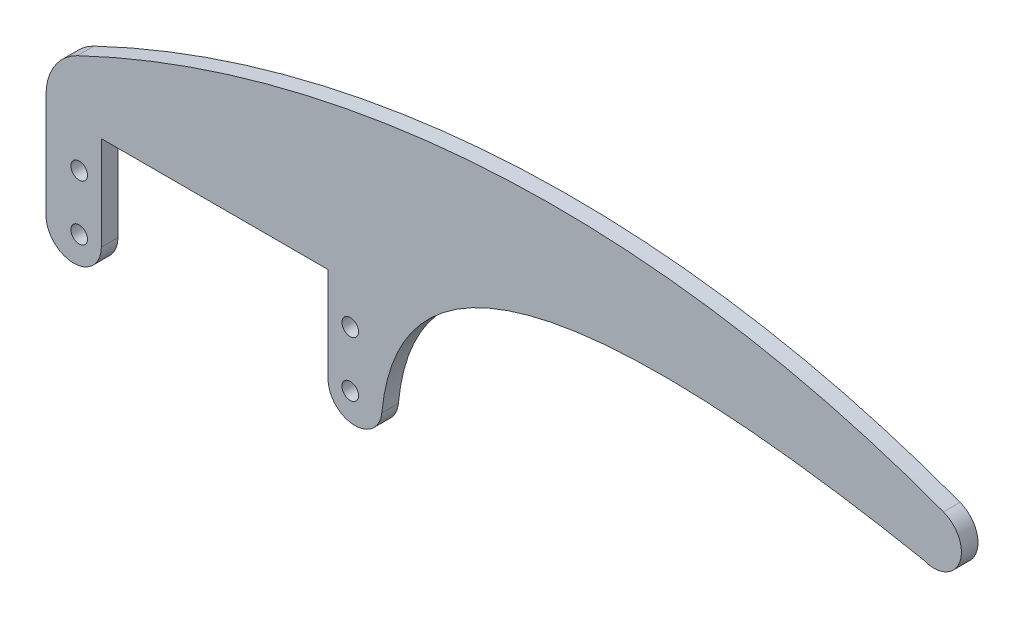
ISO-10303-21;
HEADER;
FILE_DESCRIPTION(('STEP AP214'),'2;1');
FILE_NAME('part.step','',(''),(''),'','','');
FILE_SCHEMA(('AUTOMOTIVE_DESIGN { 1 0 10303 214 1 1 1 1 }'));
ENDSEC;
DATA;
#1=APPLICATION_CONTEXT('core data for automotive mechanical design processes');
#2=APPLICATION_PROTOCOL_DEFINITION('international standard','automotive_design',2000,#1);
#3=PRODUCT_CONTEXT('',#1,'mechanical');
#4=PRODUCT('Part','Part','',(#3));
#5=PRODUCT_RELATED_PRODUCT_CATEGORY('part','',(#4));
#6=PRODUCT_DEFINITION_FORMATION('','',#4);
#7=PRODUCT_DEFINITION_CONTEXT('part definition',#1,'design');
#8=PRODUCT_DEFINITION('design','',#6,#7);
#9=PRODUCT_DEFINITION_SHAPE('','',#8);
#10=(LENGTH_UNIT() NAMED_UNIT(*) SI_UNIT(.MILLI.,.METRE.));
#11=(NAMED_UNIT(*) PLANE_ANGLE_UNIT() SI_UNIT($,.RADIAN.));
#12=(NAMED_UNIT(*) SI_UNIT($,.STERADIAN.) SOLID_ANGLE_UNIT());
#13=UNCERTAINTY_MEASURE_WITH_UNIT(LENGTH_MEASURE(1.E-05),#10,'distance_accuracy_value','');
#14=(GEOMETRIC_REPRESENTATION_CONTEXT(3) GLOBAL_UNCERTAINTY_ASSIGNED_CONTEXT((#13)) GLOBAL_UNIT_ASSIGNED_CONTEXT((#10,
#11,#12)) REPRESENTATION_CONTEXT('',''));
#15=CARTESIAN_POINT('',(0.,0.,0.));
#16=DIRECTION('',(0.,0.,1.));
#17=DIRECTION('',(1.,0.,0.));
#18=AXIS2_PLACEMENT_3D('',#15,#16,#17);
#19=CARTESIAN_POINT('',(-35.5,-5.,0.));
#20=DIRECTION('',(0.,0.,-1.));
#21=DIRECTION('',(-1.,0.,0.));
#22=AXIS2_PLACEMENT_3D('',#19,#20,#21);
#23=CYLINDRICAL_SURFACE('',#22,5.);
#24=DIRECTION('',(0.,0.,-1.));
#25=VECTOR('',#24,1.);
#26=CARTESIAN_POINT('',(-40.5,-5.,3.));
#27=LINE('',#26,#25);
#28=CARTESIAN_POINT('',(-40.5,-5.,0.));
#29=VERTEX_POINT('',#28);
#30=CARTESIAN_POINT('',(-40.5,-5.,3.));
#31=VERTEX_POINT('',#30);
#32=EDGE_CURVE('E230',#29,#31,#27,.F.);
#33=ORIENTED_EDGE('',*,*,#32,.F.);
#34=CARTESIAN_POINT('',(-35.5,-5.,0.));
#35=DIRECTION('',(0.,0.,1.));
#36=DIRECTION('',(1.,0.,0.));
#37=AXIS2_PLACEMENT_3D('',#34,#35,#36);
#38=CIRCLE('',#37,5.);
#39=CARTESIAN_POINT('',(-30.5,-5.,0.));
#40=VERTEX_POINT('',#39);
#41=EDGE_CURVE('E43',#40,#29,#38,.F.);
#42=ORIENTED_EDGE('',*,*,#41,.F.);
#43=DIRECTION('',(0.,0.,-1.));
#44=VECTOR('',#43,1.);
#45=CARTESIAN_POINT('',(-30.5,-5.,3.));
#46=LINE('',#45,#44);
#47=CARTESIAN_POINT('',(-30.5,-5.,3.));
#48=VERTEX_POINT('',#47);
#49=EDGE_CURVE('E238',#48,#40,#46,.T.);
#50=ORIENTED_EDGE('',*,*,#49,.F.);
#51=CARTESIAN_POINT('',(-35.5,-5.,3.));
#52=DIRECTION('',(0.,0.,1.));
#53=DIRECTION('',(1.,0.,0.));
#54=AXIS2_PLACEMENT_3D('',#51,#52,#53);
#55=CIRCLE('',#54,5.);
#56=EDGE_CURVE('E11',#31,#48,#55,.T.);
#57=ORIENTED_EDGE('',*,*,#56,.F.);
#58=EDGE_LOOP('',(#33,#42,#50,#57));
#59=FACE_BOUND('',#58,.T.);
#60=ADVANCED_FACE('F35',(#59),#23,.T.);
#61=CARTESIAN_POINT('',(20.2066380381264,-5.60614040867026,3.3));
#62=CARTESIAN_POINT('',(20.2066380381264,-5.60614040866997,3.19999999999997));
#63=CARTESIAN_POINT('',(20.2066380381264,-5.60614040867039,3.10000000000004));
#64=CARTESIAN_POINT('',(20.2066380381267,-5.60614040866727,1.99999999999965));
#65=CARTESIAN_POINT('',(20.2066380381264,-5.60614040867011,0.99999999999981));
#66=CARTESIAN_POINT('',(20.2066380381264,-5.60614040867011,-0.0999999999999801));
#67=CARTESIAN_POINT('',(20.2066380381264,-5.60614040867026,-0.200000000000015));
#68=CARTESIAN_POINT('',(20.2066380381264,-5.60614040867026,-0.300000000000001));
#69=CARTESIAN_POINT('',(19.3490863988907,-14.4240322566656,3.3));
#70=CARTESIAN_POINT('',(19.3490863988911,-14.4240322566661,3.19999999999996));
#71=CARTESIAN_POINT('',(19.3490863988905,-14.4240322566655,3.10000000000006));
#72=CARTESIAN_POINT('',(19.3490863988943,-14.4240322566702,1.99999999999944));
#73=CARTESIAN_POINT('',(19.3490863988909,-14.4240322566659,0.99999999999981));
#74=CARTESIAN_POINT('',(19.3490863988909,-14.4240322566659,-0.0999999999999803));
#75=CARTESIAN_POINT('',(19.3490863988907,-14.4240322566656,-0.200000000000014));
#76=CARTESIAN_POINT('',(19.3490863988907,-14.4240322566656,-0.300000000000001));
#77=CARTESIAN_POINT('',(10.4999999999999,-13.9947522060425,3.3));
#78=CARTESIAN_POINT('',(10.4999999999995,-13.994752206043,3.19999999999999));
#79=CARTESIAN_POINT('',(10.5,-13.9947522060422,3.10000000000001));
#80=CARTESIAN_POINT('',(10.4999999999962,-13.9947522060479,1.99999999999987));
#81=CARTESIAN_POINT('',(10.4999999999996,-13.9947522060427,0.999999999999809));
#82=CARTESIAN_POINT('',(10.4999999999996,-13.9947522060427,-0.099999999999981));
#83=CARTESIAN_POINT('',(10.4999999999999,-13.9947522060425,-0.200000000000012));
#84=CARTESIAN_POINT('',(10.4999999999999,-13.9947522060425,-0.3));
#85=CARTESIAN_POINT('',(10.5,-5.13525947468932,3.3));
#86=CARTESIAN_POINT('',(10.5,-5.13525947468911,3.20000000000001));
#87=CARTESIAN_POINT('',(10.5,-5.13525947468935,3.09999999999999));
#88=CARTESIAN_POINT('',(10.5,-5.13525947468696,2.00000000000009));
#89=CARTESIAN_POINT('',(10.5,-5.13525947468913,0.999999999999809));
#90=CARTESIAN_POINT('',(10.5,-5.13525947468913,-0.099999999999981));
#91=CARTESIAN_POINT('',(10.5,-5.13525947468932,-0.200000000000012));
#92=CARTESIAN_POINT('',(10.5,-5.13525947468932,-0.3));
#93=(BOUNDED_SURFACE() B_SPLINE_SURFACE(3,3,((#61,#62,#63,#64,#65,#66,#67,#68),(#69,#70,#71,#72,
#73,#74,#75,#76),(#77,#78,#79,#80,#81,#82,#83,#84),(#85,#86,#87,#88,#89,#90,#91,#92)),
.UNSPECIFIED.,.F.,.F.,.F.) B_SPLINE_SURFACE_WITH_KNOTS((4,4),(4,2,2,4),(0.,1.),(-0.1,0.,1.,1.1),
.UNSPECIFIED.) GEOMETRIC_REPRESENTATION_ITEM() RATIONAL_B_SPLINE_SURFACE(((1.,1.,1.,1.,1.,1.,1.,
1.),(0.365636164781296,0.365636164781296,0.365636164781282,0.365636164781282,0.365636164781282,
0.365636164781282,0.365636164781296,0.365636164781296),(0.365636164781296,0.365636164781296,
0.365636164781282,0.365636164781282,0.365636164781282,0.365636164781282,0.365636164781296,
0.365636164781296),(1.,1.,1.,1.,1.,1.,1.,1.))) REPRESENTATION_ITEM('') SURFACE());
#94=CARTESIAN_POINT('',(10.5,-5.13525947468932,3.3));
#95=CARTESIAN_POINT('',(10.5,-5.13525947468911,3.20000000000001));
#96=CARTESIAN_POINT('',(10.5,-5.13525947468935,3.09999999999999));
#97=CARTESIAN_POINT('',(10.5,-5.13525947468696,2.00000000000009));
#98=CARTESIAN_POINT('',(10.5,-5.13525947468913,0.999999999999809));
#99=CARTESIAN_POINT('',(10.5,-5.13525947468913,-0.099999999999981));
#100=CARTESIAN_POINT('',(10.5,-5.13525947468932,-0.200000000000012));
#101=CARTESIAN_POINT('',(10.5,-5.13525947468932,-0.3));
#102=(BOUNDED_CURVE() B_SPLINE_CURVE(3,(#94,#95,#96,#97,#98,#99,#100,#101),.UNSPECIFIED.,.F.,
.F.) B_SPLINE_CURVE_WITH_KNOTS((4,2,2,4),(-0.1,0.,1.,1.1),
.UNSPECIFIED.) CURVE() GEOMETRIC_REPRESENTATION_ITEM() RATIONAL_B_SPLINE_CURVE((1.,1.,1.,1.,1.,
1.,1.,1.)) REPRESENTATION_ITEM(''));
#103=CARTESIAN_POINT('',(10.5,-5.13525947468913,0.));
#104=VERTEX_POINT('',#103);
#105=CARTESIAN_POINT('',(10.5,-5.13525947468913,3.));
#106=VERTEX_POINT('',#105);
#107=EDGE_CURVE('E153',#104,#106,#102,.F.);
#108=CARTESIAN_POINT('',(10.5,-5.13525947468913,0.));
#109=CARTESIAN_POINT('',(10.4999999999996,-13.9947522060427,0.));
#110=CARTESIAN_POINT('',(19.3490863988909,-14.4240322566659,0.));
#111=CARTESIAN_POINT('',(20.2066380381264,-5.60614040867011,0.));
#112=(BOUNDED_CURVE() B_SPLINE_CURVE(3,(#108,#109,#110,#111),.UNSPECIFIED.,.F.,
.F.) B_SPLINE_CURVE_WITH_KNOTS((4,4),(0.,1.),
.UNSPECIFIED.) CURVE() GEOMETRIC_REPRESENTATION_ITEM() RATIONAL_B_SPLINE_CURVE((1.,
0.365636164781282,0.365636164781282,1.)) REPRESENTATION_ITEM(''));
#113=CARTESIAN_POINT('',(20.2066380381264,-5.60614040867011,0.));
#114=VERTEX_POINT('',#113);
#115=EDGE_CURVE('E284',#114,#104,#112,.F.);
#116=CARTESIAN_POINT('',(20.2066380381264,-5.60614040867011,3.00000000000062));
#117=DIRECTION('',(0.,0.,-1.));
#118=VECTOR('',#117,1.);
#119=LINE('',#116,#118);
#120=CARTESIAN_POINT('',(20.2066380381264,-5.60614040867011,3.));
#121=VERTEX_POINT('',#120);
#122=EDGE_CURVE('E282',#121,#114,#119,.T.);
#123=CARTESIAN_POINT('',(20.2066380381264,-5.60614040867011,3.));
#124=CARTESIAN_POINT('',(19.3490863988909,-14.4240322566659,3.));
#125=CARTESIAN_POINT('',(10.4999999999996,-13.9947522060427,3.));
#126=CARTESIAN_POINT('',(10.5,-5.13525947468913,3.));
#127=(BOUNDED_CURVE() B_SPLINE_CURVE(3,(#123,#124,#125,#126),.UNSPECIFIED.,.F.,
.F.) B_SPLINE_CURVE_WITH_KNOTS((4,4),(0.,1.),
.UNSPECIFIED.) CURVE() GEOMETRIC_REPRESENTATION_ITEM() RATIONAL_B_SPLINE_CURVE((1.,
0.365636164781282,0.365636164781282,1.)) REPRESENTATION_ITEM(''));
#128=EDGE_CURVE('E226',#106,#121,#127,.F.);
#129=ORIENTED_EDGE('',*,*,#107,.F.);
#130=ORIENTED_EDGE('',*,*,#115,.F.);
#131=ORIENTED_EDGE('',*,*,#122,.F.);
#132=ORIENTED_EDGE('',*,*,#128,.F.);
#133=EDGE_LOOP('',(#129,#130,#131,#132));
#134=FACE_BOUND('',#133,.T.);
#135=ADVANCED_FACE('F189',(#134),#93,.T.);
#136=CARTESIAN_POINT('',(-30.5,13.8109959771921,3.));
#137=DIRECTION('',(0.,0.,-1.));
#138=DIRECTION('',(-1.,0.,0.));
#139=AXIS2_PLACEMENT_3D('',#136,#137,#138);
#140=CYLINDRICAL_SURFACE('',#139,10.);
#141=DIRECTION('',(0.,0.,-1.));
#142=VECTOR('',#141,1.);
#143=CARTESIAN_POINT('',(-40.5,13.8109959771921,3.));
#144=LINE('',#143,#142);
#145=CARTESIAN_POINT('',(-40.5,13.8109959771917,3.));
#146=VERTEX_POINT('',#145);
#147=CARTESIAN_POINT('',(-40.5,13.8109959771917,0.));
#148=VERTEX_POINT('',#147);
#149=EDGE_CURVE('E125',#146,#148,#144,.T.);
#150=ORIENTED_EDGE('',*,*,#149,.F.);
#151=CARTESIAN_POINT('',(-30.5,13.8109959771921,3.));
#152=DIRECTION('',(0.,0.,1.));
#153=DIRECTION('',(1.,0.,0.));
#154=AXIS2_PLACEMENT_3D('',#151,#152,#153);
#155=CIRCLE('',#154,10.);
#156=CARTESIAN_POINT('',(-34.816449073427,22.831432075104,3.));
#157=VERTEX_POINT('',#156);
#158=EDGE_CURVE('E278',#157,#146,#155,.T.);
#159=ORIENTED_EDGE('',*,*,#158,.F.);
#160=DIRECTION('',(0.,0.,-1.));
#161=VECTOR('',#160,1.);
#162=CARTESIAN_POINT('',(-34.816449073427,22.831432075104,3.));
#163=LINE('',#162,#161);
#164=CARTESIAN_POINT('',(-34.816449073427,22.831432075104,0.));
#165=VERTEX_POINT('',#164);
#166=EDGE_CURVE('E275',#165,#157,#163,.F.);
#167=ORIENTED_EDGE('',*,*,#166,.F.);
#168=CARTESIAN_POINT('',(-30.5,13.8109959771921,0.));
#169=DIRECTION('',(0.,0.,1.));
#170=DIRECTION('',(1.,0.,0.));
#171=AXIS2_PLACEMENT_3D('',#168,#169,#170);
#172=CIRCLE('',#171,10.);
#173=EDGE_CURVE('E279',#148,#165,#172,.F.);
#174=ORIENTED_EDGE('',*,*,#173,.F.);
#175=EDGE_LOOP('',(#150,#159,#167,#174));
#176=FACE_BOUND('',#175,.T.);
#177=ADVANCED_FACE('F187',(#176),#140,.T.);
#178=CARTESIAN_POINT('',(51.5125323951132,-157.577289883133,3.));
#179=DIRECTION('',(0.,0.,1.));
#180=DIRECTION('',(1.,0.,0.));
#181=AXIS2_PLACEMENT_3D('',#178,#179,#180);
#182=PLANE('',#181);
#183=CARTESIAN_POINT('',(14.5,5.,3.));
#184=DIRECTION('',(0.,0.,1.));
#185=DIRECTION('',(1.,0.,0.));
#186=AXIS2_PLACEMENT_3D('',#183,#184,#185);
#187=CIRCLE('',#186,1.5);
#188=CARTESIAN_POINT('',(16.,5.,3.));
#189=VERTEX_POINT('',#188);
#190=EDGE_CURVE('E435',#189,#189,#187,.T.);
#191=ORIENTED_EDGE('',*,*,#190,.F.);
#192=EDGE_LOOP('',(#191));
#193=FACE_BOUND('',#192,.T.);
#194=CARTESIAN_POINT('',(-34.5,-5.,3.));
#195=DIRECTION('',(0.,0.,1.));
#196=DIRECTION('',(1.,0.,0.));
#197=AXIS2_PLACEMENT_3D('',#194,#195,#196);
#198=CIRCLE('',#197,1.5);
#199=CARTESIAN_POINT('',(-33.,-5.,3.));
#200=VERTEX_POINT('',#199);
#201=EDGE_CURVE('E252',#200,#200,#198,.T.);
#202=ORIENTED_EDGE('',*,*,#201,.F.);
#203=EDGE_LOOP('',(#202));
#204=FACE_BOUND('',#203,.T.);
#205=DIRECTION('',(0.,-1.,0.));
#206=VECTOR('',#205,1.);
#207=CARTESIAN_POINT('',(-40.5,20.,3.));
#208=LINE('',#207,#206);
#209=EDGE_CURVE('E116',#146,#31,#208,.T.);
#210=ORIENTED_EDGE('',*,*,#209,.T.);
#211=ORIENTED_EDGE('',*,*,#56,.T.);
#212=DIRECTION('',(0.,1.,0.));
#213=VECTOR('',#212,1.);
#214=CARTESIAN_POINT('',(-30.5,-10.,3.));
#215=LINE('',#214,#213);
#216=CARTESIAN_POINT('',(-30.5,12.,3.));
#217=VERTEX_POINT('',#216);
#218=EDGE_CURVE('E107',#48,#217,#215,.T.);
#219=ORIENTED_EDGE('',*,*,#218,.T.);
#220=DIRECTION('',(1.,0.,0.));
#221=VECTOR('',#220,1.);
#222=CARTESIAN_POINT('',(-30.5,12.,3.));
#223=LINE('',#222,#221);
#224=CARTESIAN_POINT('',(10.5,12.,3.));
#225=VERTEX_POINT('',#224);
#226=EDGE_CURVE('E113',#217,#225,#223,.T.);
#227=ORIENTED_EDGE('',*,*,#226,.T.);
#228=DIRECTION('',(0.,-1.,0.));
#229=VECTOR('',#228,1.);
#230=CARTESIAN_POINT('',(10.5,-10.,3.));
#231=LINE('',#230,#229);
#232=EDGE_CURVE('E131',#225,#106,#231,.T.);
#233=ORIENTED_EDGE('',*,*,#232,.T.);
#234=ORIENTED_EDGE('',*,*,#128,.T.);
#235=CARTESIAN_POINT('',(20.,-10.,3.));
#236=CARTESIAN_POINT('',(20.,39.4361634219413,3.));
#237=CARTESIAN_POINT('',(118.084820575141,20.3813326845727,3.));
#238=B_SPLINE_CURVE_WITH_KNOTS('',2,(#235,#236,#237),.UNSPECIFIED.,.F.,.F.,(3,3),(0.,1.),.UNSPECIFIED.);
#239=CARTESIAN_POINT('',(118.084820575141,20.3813326845727,3.));
#240=VERTEX_POINT('',#239);
#241=EDGE_CURVE('E133',#121,#240,#238,.T.);
#242=ORIENTED_EDGE('',*,*,#241,.T.);
#243=CARTESIAN_POINT('',(120.,25.,3.));
#244=DIRECTION('',(0.,0.,1.));
#245=DIRECTION('',(1.,0.,0.));
#246=AXIS2_PLACEMENT_3D('',#243,#244,#245);
#247=CIRCLE('',#246,5.00000000000004);
#248=CARTESIAN_POINT('',(121.756088912946,29.6814689713624,3.));
#249=VERTEX_POINT('',#248);
#250=EDGE_CURVE('E270',#240,#249,#247,.T.);
#251=ORIENTED_EDGE('',*,*,#250,.T.);
#252=CARTESIAN_POINT('',(51.5125323951132,-157.577289883133,3.));
#253=DIRECTION('',(0.,0.,1.));
#254=DIRECTION('',(1.,0.,0.));
#255=AXIS2_PLACEMENT_3D('',#252,#253,#254);
#256=CIRCLE('',#255,200.);
#257=EDGE_CURVE('E265',#249,#157,#256,.T.);
#258=ORIENTED_EDGE('',*,*,#257,.T.);
#259=ORIENTED_EDGE('',*,*,#158,.T.);
#260=EDGE_LOOP('',(#210,#211,#219,#227,#233,#234,#242,#251,#258,#259));
#261=FACE_BOUND('',#260,.T.);
#262=CARTESIAN_POINT('',(-34.5,5.,3.));
#263=DIRECTION('',(0.,0.,1.));
#264=DIRECTION('',(1.,0.,0.));
#265=AXIS2_PLACEMENT_3D('',#262,#263,#264);
#266=CIRCLE('',#265,1.5);
#267=CARTESIAN_POINT('',(-33.,5.,3.));
#268=VERTEX_POINT('',#267);
#269=EDGE_CURVE('E441',#268,#268,#266,.T.);
#270=ORIENTED_EDGE('',*,*,#269,.F.);
#271=EDGE_LOOP('',(#270));
#272=FACE_BOUND('',#271,.T.);
#273=CARTESIAN_POINT('',(14.5,-5.,3.));
#274=DIRECTION('',(0.,0.,1.));
#275=DIRECTION('',(1.,0.,0.));
#276=AXIS2_PLACEMENT_3D('',#273,#274,#275);
#277=CIRCLE('',#276,1.5);
#278=CARTESIAN_POINT('',(16.,-5.,3.));
#279=VERTEX_POINT('',#278);
#280=EDGE_CURVE('E426',#279,#279,#277,.T.);
#281=ORIENTED_EDGE('',*,*,#280,.F.);
#282=EDGE_LOOP('',(#281));
#283=FACE_BOUND('',#282,.T.);
#284=ADVANCED_FACE('F109',(#193,#204,#261,#272,#283),#182,.T.);
#285=CARTESIAN_POINT('',(51.5125323951132,-157.577289883133,0.));
#286=DIRECTION('',(0.,0.,1.));
#287=DIRECTION('',(1.,0.,0.));
#288=AXIS2_PLACEMENT_3D('',#285,#286,#287);
#289=PLANE('',#288);
#290=DIRECTION('',(0.,1.,0.));
#291=VECTOR('',#290,1.);
#292=CARTESIAN_POINT('',(-30.5,-10.,0.));
#293=LINE('',#292,#291);
#294=CARTESIAN_POINT('',(-30.5,12.,0.));
#295=VERTEX_POINT('',#294);
#296=EDGE_CURVE('E122',#40,#295,#293,.T.);
#297=ORIENTED_EDGE('',*,*,#296,.F.);
#298=ORIENTED_EDGE('',*,*,#41,.T.);
#299=DIRECTION('',(0.,-1.,0.));
#300=VECTOR('',#299,1.);
#301=CARTESIAN_POINT('',(-40.5,20.,0.));
#302=LINE('',#301,#300);
#303=EDGE_CURVE('E243',#148,#29,#302,.T.);
#304=ORIENTED_EDGE('',*,*,#303,.F.);
#305=ORIENTED_EDGE('',*,*,#173,.T.);
#306=CARTESIAN_POINT('',(51.5125323951132,-157.577289883133,0.));
#307=DIRECTION('',(0.,0.,1.));
#308=DIRECTION('',(1.,0.,0.));
#309=AXIS2_PLACEMENT_3D('',#306,#307,#308);
#310=CIRCLE('',#309,200.);
#311=CARTESIAN_POINT('',(121.756088912946,29.6814689713624,0.));
#312=VERTEX_POINT('',#311);
#313=EDGE_CURVE('E247',#312,#165,#310,.T.);
#314=ORIENTED_EDGE('',*,*,#313,.F.);
#315=CARTESIAN_POINT('',(120.,25.,0.));
#316=DIRECTION('',(0.,0.,1.));
#317=DIRECTION('',(1.,0.,0.));
#318=AXIS2_PLACEMENT_3D('',#315,#316,#317);
#319=CIRCLE('',#318,5.00000000000004);
#320=CARTESIAN_POINT('',(118.084820575141,20.3813326845727,0.));
#321=VERTEX_POINT('',#320);
#322=EDGE_CURVE('E260',#321,#312,#319,.T.);
#323=ORIENTED_EDGE('',*,*,#322,.F.);
#324=CARTESIAN_POINT('',(20.,-10.,0.));
#325=CARTESIAN_POINT('',(20.,39.4361634219413,0.));
#326=CARTESIAN_POINT('',(118.084820575141,20.3813326845727,0.));
#327=B_SPLINE_CURVE_WITH_KNOTS('',2,(#324,#325,#326),.UNSPECIFIED.,.F.,.F.,(3,3),(0.,1.),.UNSPECIFIED.);
#328=EDGE_CURVE('E158',#114,#321,#327,.T.);
#329=ORIENTED_EDGE('',*,*,#328,.F.);
#330=ORIENTED_EDGE('',*,*,#115,.T.);
#331=DIRECTION('',(0.,-1.,0.));
#332=VECTOR('',#331,1.);
#333=CARTESIAN_POINT('',(10.5,-10.,0.));
#334=LINE('',#333,#332);
#335=CARTESIAN_POINT('',(10.5,12.,0.));
#336=VERTEX_POINT('',#335);
#337=EDGE_CURVE('E145',#336,#104,#334,.T.);
#338=ORIENTED_EDGE('',*,*,#337,.F.);
#339=DIRECTION('',(1.,0.,0.));
#340=VECTOR('',#339,1.);
#341=CARTESIAN_POINT('',(-30.5,12.,0.));
#342=LINE('',#341,#340);
#343=EDGE_CURVE('E249',#295,#336,#342,.T.);
#344=ORIENTED_EDGE('',*,*,#343,.F.);
#345=EDGE_LOOP('',(#297,#298,#304,#305,#314,#323,#329,#330,#338,#344));
#346=FACE_BOUND('',#345,.T.);
#347=CARTESIAN_POINT('',(-34.5,-5.,0.));
#348=DIRECTION('',(0.,0.,1.));
#349=DIRECTION('',(1.,0.,0.));
#350=AXIS2_PLACEMENT_3D('',#347,#348,#349);
#351=CIRCLE('',#350,1.5);
#352=CARTESIAN_POINT('',(-33.,-5.,0.));
#353=VERTEX_POINT('',#352);
#354=EDGE_CURVE('E444',#353,#353,#351,.T.);
#355=ORIENTED_EDGE('',*,*,#354,.T.);
#356=EDGE_LOOP('',(#355));
#357=FACE_BOUND('',#356,.T.);
#358=CARTESIAN_POINT('',(-34.5,5.,0.));
#359=DIRECTION('',(0.,0.,1.));
#360=DIRECTION('',(1.,0.,0.));
#361=AXIS2_PLACEMENT_3D('',#358,#359,#360);
#362=CIRCLE('',#361,1.5);
#363=CARTESIAN_POINT('',(-33.,5.,0.));
#364=VERTEX_POINT('',#363);
#365=EDGE_CURVE('E438',#364,#364,#362,.T.);
#366=ORIENTED_EDGE('',*,*,#365,.T.);
#367=EDGE_LOOP('',(#366));
#368=FACE_BOUND('',#367,.T.);
#369=CARTESIAN_POINT('',(14.5,5.,0.));
#370=DIRECTION('',(0.,0.,1.));
#371=DIRECTION('',(1.,0.,0.));
#372=AXIS2_PLACEMENT_3D('',#369,#370,#371);
#373=CIRCLE('',#372,1.5);
#374=CARTESIAN_POINT('',(16.,5.,0.));
#375=VERTEX_POINT('',#374);
#376=EDGE_CURVE('E432',#375,#375,#373,.T.);
#377=ORIENTED_EDGE('',*,*,#376,.T.);
#378=EDGE_LOOP('',(#377));
#379=FACE_BOUND('',#378,.T.);
#380=CARTESIAN_POINT('',(14.5,-5.,0.));
#381=DIRECTION('',(0.,0.,1.));
#382=DIRECTION('',(1.,0.,0.));
#383=AXIS2_PLACEMENT_3D('',#380,#381,#382);
#384=CIRCLE('',#383,1.5);
#385=CARTESIAN_POINT('',(16.,-5.,0.));
#386=VERTEX_POINT('',#385);
#387=EDGE_CURVE('E429',#386,#386,#384,.T.);
#388=ORIENTED_EDGE('',*,*,#387,.T.);
#389=EDGE_LOOP('',(#388));
#390=FACE_BOUND('',#389,.T.);
#391=ADVANCED_FACE('F185',(#346,#357,#368,#379,#390),#289,.F.);
#392=CARTESIAN_POINT('',(51.5125323951132,-157.577289883133,3.));
#393=DIRECTION('',(0.,0.,-1.));
#394=DIRECTION('',(-1.,0.,0.));
#395=AXIS2_PLACEMENT_3D('',#392,#393,#394);
#396=CYLINDRICAL_SURFACE('',#395,200.);
#397=ORIENTED_EDGE('',*,*,#313,.T.);
#398=ORIENTED_EDGE('',*,*,#166,.T.);
#399=ORIENTED_EDGE('',*,*,#257,.F.);
#400=DIRECTION('',(0.,0.,-1.));
#401=VECTOR('',#400,1.);
#402=CARTESIAN_POINT('',(121.756088912946,29.6814689713624,3.));
#403=LINE('',#402,#401);
#404=EDGE_CURVE('E266',#249,#312,#403,.T.);
#405=ORIENTED_EDGE('',*,*,#404,.T.);
#406=EDGE_LOOP('',(#397,#398,#399,#405));
#407=FACE_BOUND('',#406,.T.);
#408=ADVANCED_FACE('F181',(#407),#396,.T.);
#409=CARTESIAN_POINT('',(-40.5,20.,3.));
#410=DIRECTION('',(1.,0.,0.));
#411=DIRECTION('',(0.,1.,0.));
#412=AXIS2_PLACEMENT_3D('',#409,#410,#411);
#413=PLANE('',#412);
#414=ORIENTED_EDGE('',*,*,#303,.T.);
#415=ORIENTED_EDGE('',*,*,#32,.T.);
#416=ORIENTED_EDGE('',*,*,#209,.F.);
#417=ORIENTED_EDGE('',*,*,#149,.T.);
#418=EDGE_LOOP('',(#414,#415,#416,#417));
#419=FACE_BOUND('',#418,.T.);
#420=ADVANCED_FACE('F178',(#419),#413,.F.);
#421=CARTESIAN_POINT('',(-30.5,-10.,3.));
#422=DIRECTION('',(-1.,0.,0.));
#423=DIRECTION('',(0.,0.,1.));
#424=AXIS2_PLACEMENT_3D('',#421,#422,#423);
#425=PLANE('',#424);
#426=ORIENTED_EDGE('',*,*,#218,.F.);
#427=ORIENTED_EDGE('',*,*,#49,.T.);
#428=ORIENTED_EDGE('',*,*,#296,.T.);
#429=DIRECTION('',(0.,0.,-1.));
#430=VECTOR('',#429,1.);
#431=CARTESIAN_POINT('',(-30.5,12.,3.));
#432=LINE('',#431,#430);
#433=EDGE_CURVE('E119',#217,#295,#432,.T.);
#434=ORIENTED_EDGE('',*,*,#433,.F.);
#435=EDGE_LOOP('',(#426,#427,#428,#434));
#436=FACE_BOUND('',#435,.T.);
#437=ADVANCED_FACE('F120',(#436),#425,.F.);
#438=CARTESIAN_POINT('',(-30.5,12.,3.));
#439=DIRECTION('',(0.,1.,0.));
#440=DIRECTION('',(0.,0.,1.));
#441=AXIS2_PLACEMENT_3D('',#438,#439,#440);
#442=PLANE('',#441);
#443=ORIENTED_EDGE('',*,*,#343,.T.);
#444=DIRECTION('',(0.,0.,-1.));
#445=VECTOR('',#444,1.);
#446=CARTESIAN_POINT('',(10.5,12.,3.));
#447=LINE('',#446,#445);
#448=EDGE_CURVE('E126',#225,#336,#447,.T.);
#449=ORIENTED_EDGE('',*,*,#448,.F.);
#450=ORIENTED_EDGE('',*,*,#226,.F.);
#451=ORIENTED_EDGE('',*,*,#433,.T.);
#452=EDGE_LOOP('',(#443,#449,#450,#451));
#453=FACE_BOUND('',#452,.T.);
#454=ADVANCED_FACE('F128',(#453),#442,.F.);
#455=CARTESIAN_POINT('',(10.5,-10.,3.));
#456=DIRECTION('',(1.,0.,0.));
#457=DIRECTION('',(0.,1.,0.));
#458=AXIS2_PLACEMENT_3D('',#455,#456,#457);
#459=PLANE('',#458);
#460=ORIENTED_EDGE('',*,*,#337,.T.);
#461=ORIENTED_EDGE('',*,*,#107,.T.);
#462=ORIENTED_EDGE('',*,*,#232,.F.);
#463=ORIENTED_EDGE('',*,*,#448,.T.);
#464=EDGE_LOOP('',(#460,#461,#462,#463));
#465=FACE_BOUND('',#464,.T.);
#466=ADVANCED_FACE('F161',(#465),#459,.F.);
#467=DIRECTION('',(0.,0.,-1.));
#468=VECTOR('',#467,1.);
#469=SURFACE_OF_LINEAR_EXTRUSION('',#238,#468);
#470=ORIENTED_EDGE('',*,*,#241,.F.);
#471=ORIENTED_EDGE('',*,*,#122,.T.);
#472=ORIENTED_EDGE('',*,*,#328,.T.);
#473=DIRECTION('',(0.,0.,-1.));
#474=VECTOR('',#473,1.);
#475=CARTESIAN_POINT('',(118.084820575141,20.3813326845727,3.));
#476=LINE('',#475,#474);
#477=EDGE_CURVE('E269',#240,#321,#476,.T.);
#478=ORIENTED_EDGE('',*,*,#477,.F.);
#479=EDGE_LOOP('',(#470,#471,#472,#478));
#480=FACE_BOUND('',#479,.T.);
#481=ADVANCED_FACE('F171',(#480),#469,.F.);
#482=CARTESIAN_POINT('',(120.,25.,3.));
#483=DIRECTION('',(0.,0.,-1.));
#484=DIRECTION('',(-1.,0.,0.));
#485=AXIS2_PLACEMENT_3D('',#482,#483,#484);
#486=CYLINDRICAL_SURFACE('',#485,5.00000000000004);
#487=ORIENTED_EDGE('',*,*,#322,.T.);
#488=ORIENTED_EDGE('',*,*,#404,.F.);
#489=ORIENTED_EDGE('',*,*,#250,.F.);
#490=ORIENTED_EDGE('',*,*,#477,.T.);
#491=EDGE_LOOP('',(#487,#488,#489,#490));
#492=FACE_BOUND('',#491,.T.);
#493=ADVANCED_FACE('F317',(#492),#486,.T.);
#494=CARTESIAN_POINT('',(-34.5,-5.,3.));
#495=DIRECTION('',(0.,0.,-1.));
#496=DIRECTION('',(-1.,0.,0.));
#497=AXIS2_PLACEMENT_3D('',#494,#495,#496);
#498=CYLINDRICAL_SURFACE('',#497,1.5);
#499=ORIENTED_EDGE('',*,*,#201,.T.);
#500=EDGE_LOOP('',(#499));
#501=FACE_BOUND('',#500,.T.);
#502=ORIENTED_EDGE('',*,*,#354,.F.);
#503=EDGE_LOOP('',(#502));
#504=FACE_BOUND('',#503,.T.);
#505=ADVANCED_FACE('F319',(#501,#504),#498,.F.);
#506=CARTESIAN_POINT('',(-34.5,5.,3.));
#507=DIRECTION('',(0.,0.,-1.));
#508=DIRECTION('',(-1.,0.,0.));
#509=AXIS2_PLACEMENT_3D('',#506,#507,#508);
#510=CYLINDRICAL_SURFACE('',#509,1.5);
#511=ORIENTED_EDGE('',*,*,#269,.T.);
#512=EDGE_LOOP('',(#511));
#513=FACE_BOUND('',#512,.T.);
#514=ORIENTED_EDGE('',*,*,#365,.F.);
#515=EDGE_LOOP('',(#514));
#516=FACE_BOUND('',#515,.T.);
#517=ADVANCED_FACE('F325',(#513,#516),#510,.F.);
#518=CARTESIAN_POINT('',(14.5,5.,3.));
#519=DIRECTION('',(0.,0.,-1.));
#520=DIRECTION('',(-1.,0.,0.));
#521=AXIS2_PLACEMENT_3D('',#518,#519,#520);
#522=CYLINDRICAL_SURFACE('',#521,1.5);
#523=ORIENTED_EDGE('',*,*,#190,.T.);
#524=EDGE_LOOP('',(#523));
#525=FACE_BOUND('',#524,.T.);
#526=ORIENTED_EDGE('',*,*,#376,.F.);
#527=EDGE_LOOP('',(#526));
#528=FACE_BOUND('',#527,.T.);
#529=ADVANCED_FACE('F394',(#525,#528),#522,.F.);
#530=CARTESIAN_POINT('',(14.5,-5.,3.));
#531=DIRECTION('',(0.,0.,-1.));
#532=DIRECTION('',(-1.,0.,0.));
#533=AXIS2_PLACEMENT_3D('',#530,#531,#532);
#534=CYLINDRICAL_SURFACE('',#533,1.5);
#535=ORIENTED_EDGE('',*,*,#280,.T.);
#536=EDGE_LOOP('',(#535));
#537=FACE_BOUND('',#536,.T.);
#538=ORIENTED_EDGE('',*,*,#387,.F.);
#539=EDGE_LOOP('',(#538));
#540=FACE_BOUND('',#539,.T.);
#541=ADVANCED_FACE('F403',(#537,#540),#534,.F.);
#542=CLOSED_SHELL('',(#60,#135,#177,#284,#391,#408,#420,#437,#454,#466,#481,#493,#505,#517,#529,#541));
#543=MANIFOLD_SOLID_BREP('B2',#542);
#544=ADVANCED_BREP_SHAPE_REPRESENTATION('',(#18,#543),#14);
#545=SHAPE_DEFINITION_REPRESENTATION(#9,#544);
ENDSEC;
END-ISO-10303-21;
